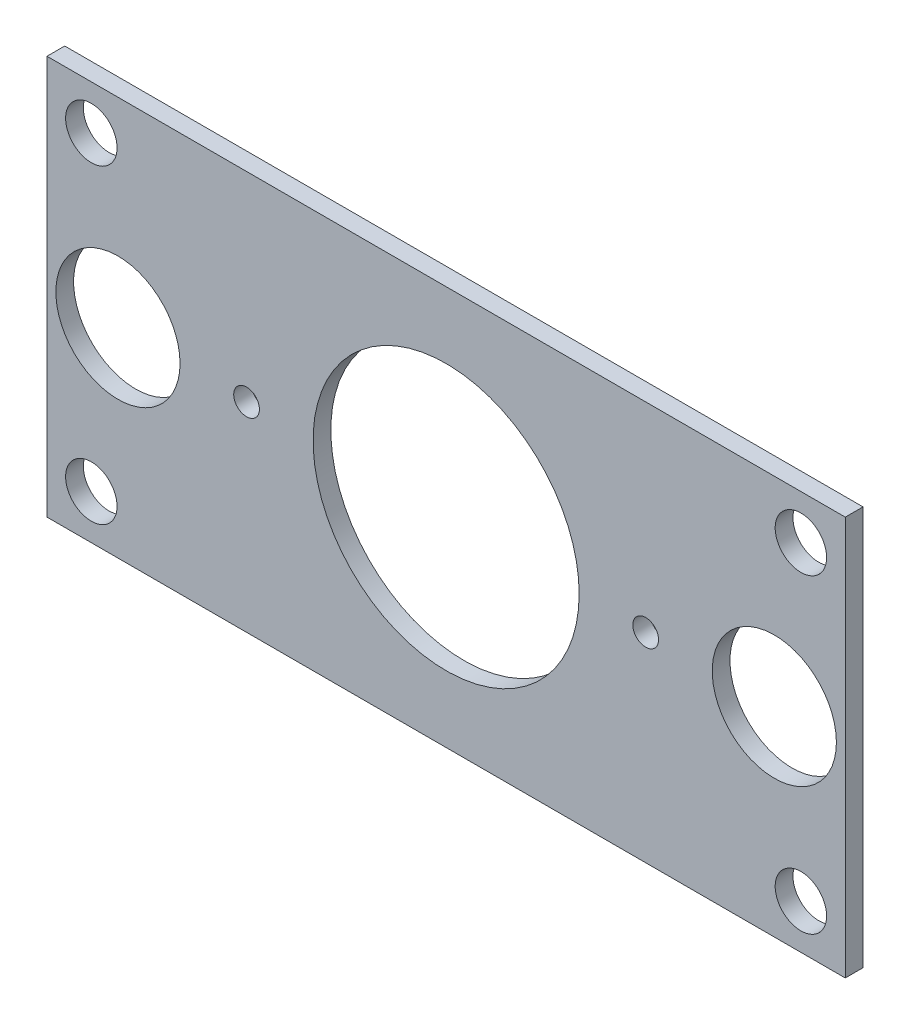
ISO-10303-21;
HEADER;
FILE_DESCRIPTION(('STEP AP214'),'2;1');
FILE_NAME('part.step','',(''),(''),'','','');
FILE_SCHEMA(('AUTOMOTIVE_DESIGN { 1 0 10303 214 1 1 1 1 }'));
ENDSEC;
DATA;
#1=APPLICATION_CONTEXT('core data for automotive mechanical design processes');
#2=APPLICATION_PROTOCOL_DEFINITION('international standard','automotive_design',2000,#1);
#3=PRODUCT_CONTEXT('',#1,'mechanical');
#4=PRODUCT('Part','Part','',(#3));
#5=PRODUCT_RELATED_PRODUCT_CATEGORY('part','',(#4));
#6=PRODUCT_DEFINITION_FORMATION('','',#4);
#7=PRODUCT_DEFINITION_CONTEXT('part definition',#1,'design');
#8=PRODUCT_DEFINITION('design','',#6,#7);
#9=PRODUCT_DEFINITION_SHAPE('','',#8);
#10=(LENGTH_UNIT() NAMED_UNIT(*) SI_UNIT(.MILLI.,.METRE.));
#11=(NAMED_UNIT(*) PLANE_ANGLE_UNIT() SI_UNIT($,.RADIAN.));
#12=(NAMED_UNIT(*) SI_UNIT($,.STERADIAN.) SOLID_ANGLE_UNIT());
#13=UNCERTAINTY_MEASURE_WITH_UNIT(LENGTH_MEASURE(1.E-05),#10,'distance_accuracy_value','');
#14=(GEOMETRIC_REPRESENTATION_CONTEXT(3) GLOBAL_UNCERTAINTY_ASSIGNED_CONTEXT((#13)) GLOBAL_UNIT_ASSIGNED_CONTEXT((#10,
#11,#12)) REPRESENTATION_CONTEXT('',''));
#15=CARTESIAN_POINT('',(0.,0.,0.));
#16=DIRECTION('',(0.,0.,1.));
#17=DIRECTION('',(1.,0.,0.));
#18=AXIS2_PLACEMENT_3D('',#15,#16,#17);
#19=CARTESIAN_POINT('',(45.,22.5,-2.));
#20=DIRECTION('',(1.,0.,0.));
#21=DIRECTION('',(0.,0.,-1.));
#22=AXIS2_PLACEMENT_3D('',#19,#20,#21);
#23=PLANE('',#22);
#24=DIRECTION('',(0.,1.,0.));
#25=VECTOR('',#24,1.);
#26=CARTESIAN_POINT('',(45.,22.5,0.));
#27=LINE('',#26,#25);
#28=CARTESIAN_POINT('',(45.,-22.5,0.));
#29=VERTEX_POINT('',#28);
#30=CARTESIAN_POINT('',(45.,22.5,0.));
#31=VERTEX_POINT('',#30);
#32=EDGE_CURVE('E99',#29,#31,#27,.T.);
#33=ORIENTED_EDGE('',*,*,#32,.F.);
#34=DIRECTION('',(0.,0.,1.));
#35=VECTOR('',#34,1.);
#36=CARTESIAN_POINT('',(45.,-22.5,-2.));
#37=LINE('',#36,#35);
#38=CARTESIAN_POINT('',(45.,-22.5,-2.));
#39=VERTEX_POINT('',#38);
#40=EDGE_CURVE('E11',#39,#29,#37,.T.);
#41=ORIENTED_EDGE('',*,*,#40,.F.);
#42=DIRECTION('',(0.,1.,0.));
#43=VECTOR('',#42,1.);
#44=CARTESIAN_POINT('',(45.,22.5,-2.));
#45=LINE('',#44,#43);
#46=CARTESIAN_POINT('',(45.,22.5,-2.));
#47=VERTEX_POINT('',#46);
#48=EDGE_CURVE('E92',#39,#47,#45,.T.);
#49=ORIENTED_EDGE('',*,*,#48,.T.);
#50=DIRECTION('',(0.,0.,1.));
#51=VECTOR('',#50,1.);
#52=CARTESIAN_POINT('',(45.,22.5,-2.));
#53=LINE('',#52,#51);
#54=EDGE_CURVE('E37',#47,#31,#53,.T.);
#55=ORIENTED_EDGE('',*,*,#54,.T.);
#56=EDGE_LOOP('',(#33,#41,#49,#55));
#57=FACE_BOUND('',#56,.T.);
#58=ADVANCED_FACE('F34',(#57),#23,.T.);
#59=CARTESIAN_POINT('',(-45.,-22.5,-2.));
#60=DIRECTION('',(0.,-1.,0.));
#61=DIRECTION('',(0.,0.,-1.));
#62=AXIS2_PLACEMENT_3D('',#59,#60,#61);
#63=PLANE('',#62);
#64=DIRECTION('',(1.,0.,0.));
#65=VECTOR('',#64,1.);
#66=CARTESIAN_POINT('',(-45.,-22.5,0.));
#67=LINE('',#66,#65);
#68=CARTESIAN_POINT('',(-45.,-22.5,0.));
#69=VERTEX_POINT('',#68);
#70=EDGE_CURVE('E94',#69,#29,#67,.T.);
#71=ORIENTED_EDGE('',*,*,#70,.F.);
#72=DIRECTION('',(0.,0.,1.));
#73=VECTOR('',#72,1.);
#74=CARTESIAN_POINT('',(-45.,-22.5,-2.));
#75=LINE('',#74,#73);
#76=CARTESIAN_POINT('',(-45.,-22.5,-2.));
#77=VERTEX_POINT('',#76);
#78=EDGE_CURVE('E43',#77,#69,#75,.T.);
#79=ORIENTED_EDGE('',*,*,#78,.F.);
#80=DIRECTION('',(1.,0.,0.));
#81=VECTOR('',#80,1.);
#82=CARTESIAN_POINT('',(-45.,-22.5,-2.));
#83=LINE('',#82,#81);
#84=EDGE_CURVE('E89',#77,#39,#83,.T.);
#85=ORIENTED_EDGE('',*,*,#84,.T.);
#86=ORIENTED_EDGE('',*,*,#40,.T.);
#87=EDGE_LOOP('',(#71,#79,#85,#86));
#88=FACE_BOUND('',#87,.T.);
#89=ADVANCED_FACE('F110',(#88),#63,.T.);
#90=CARTESIAN_POINT('',(-45.,22.5,-2.));
#91=DIRECTION('',(-1.,0.,0.));
#92=DIRECTION('',(0.,-1.,0.));
#93=AXIS2_PLACEMENT_3D('',#90,#91,#92);
#94=PLANE('',#93);
#95=DIRECTION('',(0.,-1.,0.));
#96=VECTOR('',#95,1.);
#97=CARTESIAN_POINT('',(-45.,22.5,0.));
#98=LINE('',#97,#96);
#99=CARTESIAN_POINT('',(-45.,22.5,0.));
#100=VERTEX_POINT('',#99);
#101=EDGE_CURVE('E84',#100,#69,#98,.T.);
#102=ORIENTED_EDGE('',*,*,#101,.F.);
#103=DIRECTION('',(0.,0.,1.));
#104=VECTOR('',#103,1.);
#105=CARTESIAN_POINT('',(-45.,22.5,-2.));
#106=LINE('',#105,#104);
#107=CARTESIAN_POINT('',(-45.,22.5,-2.));
#108=VERTEX_POINT('',#107);
#109=EDGE_CURVE('E79',#108,#100,#106,.T.);
#110=ORIENTED_EDGE('',*,*,#109,.F.);
#111=DIRECTION('',(0.,-1.,0.));
#112=VECTOR('',#111,1.);
#113=CARTESIAN_POINT('',(-45.,22.5,-2.));
#114=LINE('',#113,#112);
#115=EDGE_CURVE('E82',#108,#77,#114,.T.);
#116=ORIENTED_EDGE('',*,*,#115,.T.);
#117=ORIENTED_EDGE('',*,*,#78,.T.);
#118=EDGE_LOOP('',(#102,#110,#116,#117));
#119=FACE_BOUND('',#118,.T.);
#120=ADVANCED_FACE('F81',(#119),#94,.T.);
#121=CARTESIAN_POINT('',(-45.,22.5,-2.));
#122=DIRECTION('',(0.,1.,0.));
#123=DIRECTION('',(0.,0.,1.));
#124=AXIS2_PLACEMENT_3D('',#121,#122,#123);
#125=PLANE('',#124);
#126=DIRECTION('',(-1.,0.,0.));
#127=VECTOR('',#126,1.);
#128=CARTESIAN_POINT('',(-45.,22.5,0.));
#129=LINE('',#128,#127);
#130=EDGE_CURVE('E102',#31,#100,#129,.T.);
#131=ORIENTED_EDGE('',*,*,#130,.F.);
#132=ORIENTED_EDGE('',*,*,#54,.F.);
#133=DIRECTION('',(-1.,0.,0.));
#134=VECTOR('',#133,1.);
#135=CARTESIAN_POINT('',(-45.,22.5,-2.));
#136=LINE('',#135,#134);
#137=EDGE_CURVE('E88',#47,#108,#136,.T.);
#138=ORIENTED_EDGE('',*,*,#137,.T.);
#139=ORIENTED_EDGE('',*,*,#109,.T.);
#140=EDGE_LOOP('',(#131,#132,#138,#139));
#141=FACE_BOUND('',#140,.T.);
#142=ADVANCED_FACE('F91',(#141),#125,.T.);
#143=CARTESIAN_POINT('',(0.,0.,-2.));
#144=DIRECTION('',(0.,0.,1.));
#145=DIRECTION('',(1.,0.,0.));
#146=AXIS2_PLACEMENT_3D('',#143,#144,#145);
#147=PLANE('',#146);
#148=CARTESIAN_POINT('',(-22.5,0.,-2.));
#149=DIRECTION('',(0.,0.,1.));
#150=DIRECTION('',(1.,0.,0.));
#151=AXIS2_PLACEMENT_3D('',#148,#149,#150);
#152=CIRCLE('',#151,1.45);
#153=CARTESIAN_POINT('',(-21.05,0.,-2.));
#154=VERTEX_POINT('',#153);
#155=EDGE_CURVE('E171',#154,#154,#152,.T.);
#156=ORIENTED_EDGE('',*,*,#155,.T.);
#157=EDGE_LOOP('',(#156));
#158=FACE_BOUND('',#157,.T.);
#159=CARTESIAN_POINT('',(22.5,0.,-2.));
#160=DIRECTION('',(0.,0.,1.));
#161=DIRECTION('',(1.,0.,0.));
#162=AXIS2_PLACEMENT_3D('',#159,#160,#161);
#163=CIRCLE('',#162,1.45);
#164=CARTESIAN_POINT('',(23.95,0.,-2.));
#165=VERTEX_POINT('',#164);
#166=EDGE_CURVE('E179',#165,#165,#163,.T.);
#167=ORIENTED_EDGE('',*,*,#166,.T.);
#168=EDGE_LOOP('',(#167));
#169=FACE_BOUND('',#168,.T.);
#170=CARTESIAN_POINT('',(37.,0.,-2.));
#171=DIRECTION('',(0.,0.,1.));
#172=DIRECTION('',(1.,0.,0.));
#173=AXIS2_PLACEMENT_3D('',#170,#171,#172);
#174=CIRCLE('',#173,7.);
#175=CARTESIAN_POINT('',(44.,0.,-2.));
#176=VERTEX_POINT('',#175);
#177=EDGE_CURVE('E185',#176,#176,#174,.T.);
#178=ORIENTED_EDGE('',*,*,#177,.T.);
#179=EDGE_LOOP('',(#178));
#180=FACE_BOUND('',#179,.T.);
#181=CARTESIAN_POINT('',(-37.,0.,-2.));
#182=DIRECTION('',(0.,0.,1.));
#183=DIRECTION('',(1.,0.,0.));
#184=AXIS2_PLACEMENT_3D('',#181,#182,#183);
#185=CIRCLE('',#184,7.);
#186=CARTESIAN_POINT('',(-30.,0.,-2.));
#187=VERTEX_POINT('',#186);
#188=EDGE_CURVE('E191',#187,#187,#185,.T.);
#189=ORIENTED_EDGE('',*,*,#188,.T.);
#190=EDGE_LOOP('',(#189));
#191=FACE_BOUND('',#190,.T.);
#192=CARTESIAN_POINT('',(0.,0.,-2.));
#193=DIRECTION('',(0.,0.,1.));
#194=DIRECTION('',(1.,0.,0.));
#195=AXIS2_PLACEMENT_3D('',#192,#193,#194);
#196=CIRCLE('',#195,15.);
#197=CARTESIAN_POINT('',(15.,0.,-2.));
#198=VERTEX_POINT('',#197);
#199=EDGE_CURVE('E197',#198,#198,#196,.T.);
#200=ORIENTED_EDGE('',*,*,#199,.T.);
#201=EDGE_LOOP('',(#200));
#202=FACE_BOUND('',#201,.T.);
#203=CARTESIAN_POINT('',(40.0000000000001,-17.5000000000001,-2.));
#204=DIRECTION('',(0.,0.,1.));
#205=DIRECTION('',(1.,0.,0.));
#206=AXIS2_PLACEMENT_3D('',#203,#204,#205);
#207=CIRCLE('',#206,2.9);
#208=CARTESIAN_POINT('',(42.9000000000001,-17.5000000000001,-2.));
#209=VERTEX_POINT('',#208);
#210=EDGE_CURVE('E203',#209,#209,#207,.T.);
#211=ORIENTED_EDGE('',*,*,#210,.T.);
#212=EDGE_LOOP('',(#211));
#213=FACE_BOUND('',#212,.T.);
#214=CARTESIAN_POINT('',(40.0000000000001,17.5,-2.));
#215=DIRECTION('',(0.,0.,1.));
#216=DIRECTION('',(1.,0.,0.));
#217=AXIS2_PLACEMENT_3D('',#214,#215,#216);
#218=CIRCLE('',#217,2.9);
#219=CARTESIAN_POINT('',(42.9000000000001,17.5,-2.));
#220=VERTEX_POINT('',#219);
#221=EDGE_CURVE('E209',#220,#220,#218,.T.);
#222=ORIENTED_EDGE('',*,*,#221,.T.);
#223=EDGE_LOOP('',(#222));
#224=FACE_BOUND('',#223,.T.);
#225=CARTESIAN_POINT('',(-40.,-17.5000000000001,-2.));
#226=DIRECTION('',(0.,0.,1.));
#227=DIRECTION('',(1.,0.,0.));
#228=AXIS2_PLACEMENT_3D('',#225,#226,#227);
#229=CIRCLE('',#228,2.9);
#230=CARTESIAN_POINT('',(-37.1,-17.5000000000001,-2.));
#231=VERTEX_POINT('',#230);
#232=EDGE_CURVE('E215',#231,#231,#229,.T.);
#233=ORIENTED_EDGE('',*,*,#232,.T.);
#234=EDGE_LOOP('',(#233));
#235=FACE_BOUND('',#234,.T.);
#236=CARTESIAN_POINT('',(-40.,17.5,-2.));
#237=DIRECTION('',(0.,0.,1.));
#238=DIRECTION('',(1.,0.,0.));
#239=AXIS2_PLACEMENT_3D('',#236,#237,#238);
#240=CIRCLE('',#239,2.9);
#241=CARTESIAN_POINT('',(-37.1,17.5,-2.));
#242=VERTEX_POINT('',#241);
#243=EDGE_CURVE('E103',#242,#242,#240,.T.);
#244=ORIENTED_EDGE('',*,*,#243,.T.);
#245=EDGE_LOOP('',(#244));
#246=FACE_BOUND('',#245,.T.);
#247=ORIENTED_EDGE('',*,*,#48,.F.);
#248=ORIENTED_EDGE('',*,*,#84,.F.);
#249=ORIENTED_EDGE('',*,*,#115,.F.);
#250=ORIENTED_EDGE('',*,*,#137,.F.);
#251=EDGE_LOOP('',(#247,#248,#249,#250));
#252=FACE_BOUND('',#251,.T.);
#253=ADVANCED_FACE('F87',(#158,#169,#180,#191,#202,#213,#224,#235,#246,#252),#147,.F.);
#254=CARTESIAN_POINT('',(0.,0.,0.));
#255=DIRECTION('',(0.,0.,1.));
#256=DIRECTION('',(1.,0.,0.));
#257=AXIS2_PLACEMENT_3D('',#254,#255,#256);
#258=PLANE('',#257);
#259=CARTESIAN_POINT('',(-22.5,0.,0.));
#260=DIRECTION('',(0.,0.,1.));
#261=DIRECTION('',(1.,0.,0.));
#262=AXIS2_PLACEMENT_3D('',#259,#260,#261);
#263=CIRCLE('',#262,1.45);
#264=CARTESIAN_POINT('',(-21.05,0.,0.));
#265=VERTEX_POINT('',#264);
#266=EDGE_CURVE('E174',#265,#265,#263,.T.);
#267=ORIENTED_EDGE('',*,*,#266,.F.);
#268=EDGE_LOOP('',(#267));
#269=FACE_BOUND('',#268,.T.);
#270=CARTESIAN_POINT('',(22.5,0.,0.));
#271=DIRECTION('',(0.,0.,1.));
#272=DIRECTION('',(1.,0.,0.));
#273=AXIS2_PLACEMENT_3D('',#270,#271,#272);
#274=CIRCLE('',#273,1.45);
#275=CARTESIAN_POINT('',(23.95,0.,0.));
#276=VERTEX_POINT('',#275);
#277=EDGE_CURVE('E176',#276,#276,#274,.T.);
#278=ORIENTED_EDGE('',*,*,#277,.F.);
#279=EDGE_LOOP('',(#278));
#280=FACE_BOUND('',#279,.T.);
#281=CARTESIAN_POINT('',(37.,0.,0.));
#282=DIRECTION('',(0.,0.,1.));
#283=DIRECTION('',(1.,0.,0.));
#284=AXIS2_PLACEMENT_3D('',#281,#282,#283);
#285=CIRCLE('',#284,7.);
#286=CARTESIAN_POINT('',(44.,0.,0.));
#287=VERTEX_POINT('',#286);
#288=EDGE_CURVE('E182',#287,#287,#285,.T.);
#289=ORIENTED_EDGE('',*,*,#288,.F.);
#290=EDGE_LOOP('',(#289));
#291=FACE_BOUND('',#290,.T.);
#292=CARTESIAN_POINT('',(-37.,0.,0.));
#293=DIRECTION('',(0.,0.,1.));
#294=DIRECTION('',(1.,0.,0.));
#295=AXIS2_PLACEMENT_3D('',#292,#293,#294);
#296=CIRCLE('',#295,7.);
#297=CARTESIAN_POINT('',(-30.,0.,0.));
#298=VERTEX_POINT('',#297);
#299=EDGE_CURVE('E188',#298,#298,#296,.T.);
#300=ORIENTED_EDGE('',*,*,#299,.F.);
#301=EDGE_LOOP('',(#300));
#302=FACE_BOUND('',#301,.T.);
#303=CARTESIAN_POINT('',(0.,0.,0.));
#304=DIRECTION('',(0.,0.,1.));
#305=DIRECTION('',(1.,0.,0.));
#306=AXIS2_PLACEMENT_3D('',#303,#304,#305);
#307=CIRCLE('',#306,15.);
#308=CARTESIAN_POINT('',(15.,0.,0.));
#309=VERTEX_POINT('',#308);
#310=EDGE_CURVE('E194',#309,#309,#307,.T.);
#311=ORIENTED_EDGE('',*,*,#310,.F.);
#312=EDGE_LOOP('',(#311));
#313=FACE_BOUND('',#312,.T.);
#314=CARTESIAN_POINT('',(40.0000000000001,-17.5000000000001,0.));
#315=DIRECTION('',(0.,0.,1.));
#316=DIRECTION('',(1.,0.,0.));
#317=AXIS2_PLACEMENT_3D('',#314,#315,#316);
#318=CIRCLE('',#317,2.9);
#319=CARTESIAN_POINT('',(42.9000000000001,-17.5000000000001,0.));
#320=VERTEX_POINT('',#319);
#321=EDGE_CURVE('E200',#320,#320,#318,.T.);
#322=ORIENTED_EDGE('',*,*,#321,.F.);
#323=EDGE_LOOP('',(#322));
#324=FACE_BOUND('',#323,.T.);
#325=CARTESIAN_POINT('',(40.0000000000001,17.5,0.));
#326=DIRECTION('',(0.,0.,1.));
#327=DIRECTION('',(1.,0.,0.));
#328=AXIS2_PLACEMENT_3D('',#325,#326,#327);
#329=CIRCLE('',#328,2.9);
#330=CARTESIAN_POINT('',(42.9000000000001,17.5,0.));
#331=VERTEX_POINT('',#330);
#332=EDGE_CURVE('E206',#331,#331,#329,.T.);
#333=ORIENTED_EDGE('',*,*,#332,.F.);
#334=EDGE_LOOP('',(#333));
#335=FACE_BOUND('',#334,.T.);
#336=CARTESIAN_POINT('',(-40.,-17.5000000000001,0.));
#337=DIRECTION('',(0.,0.,1.));
#338=DIRECTION('',(1.,0.,0.));
#339=AXIS2_PLACEMENT_3D('',#336,#337,#338);
#340=CIRCLE('',#339,2.9);
#341=CARTESIAN_POINT('',(-37.1,-17.5000000000001,0.));
#342=VERTEX_POINT('',#341);
#343=EDGE_CURVE('E212',#342,#342,#340,.T.);
#344=ORIENTED_EDGE('',*,*,#343,.F.);
#345=EDGE_LOOP('',(#344));
#346=FACE_BOUND('',#345,.T.);
#347=CARTESIAN_POINT('',(-40.,17.5,0.));
#348=DIRECTION('',(0.,0.,1.));
#349=DIRECTION('',(1.,0.,0.));
#350=AXIS2_PLACEMENT_3D('',#347,#348,#349);
#351=CIRCLE('',#350,2.9);
#352=CARTESIAN_POINT('',(-37.1,17.5,0.));
#353=VERTEX_POINT('',#352);
#354=EDGE_CURVE('E218',#353,#353,#351,.T.);
#355=ORIENTED_EDGE('',*,*,#354,.F.);
#356=EDGE_LOOP('',(#355));
#357=FACE_BOUND('',#356,.T.);
#358=ORIENTED_EDGE('',*,*,#32,.T.);
#359=ORIENTED_EDGE('',*,*,#130,.T.);
#360=ORIENTED_EDGE('',*,*,#101,.T.);
#361=ORIENTED_EDGE('',*,*,#70,.T.);
#362=EDGE_LOOP('',(#358,#359,#360,#361));
#363=FACE_BOUND('',#362,.T.);
#364=ADVANCED_FACE('F109',(#269,#280,#291,#302,#313,#324,#335,#346,#357,#363),#258,.T.);
#365=CARTESIAN_POINT('',(-40.,17.5,-2.));
#366=DIRECTION('',(0.,0.,1.));
#367=DIRECTION('',(1.,0.,0.));
#368=AXIS2_PLACEMENT_3D('',#365,#366,#367);
#369=CYLINDRICAL_SURFACE('',#368,2.9);
#370=ORIENTED_EDGE('',*,*,#243,.F.);
#371=EDGE_LOOP('',(#370));
#372=FACE_BOUND('',#371,.T.);
#373=ORIENTED_EDGE('',*,*,#354,.T.);
#374=EDGE_LOOP('',(#373));
#375=FACE_BOUND('',#374,.T.);
#376=ADVANCED_FACE('F128',(#372,#375),#369,.F.);
#377=CARTESIAN_POINT('',(-40.,-17.5000000000001,-2.));
#378=DIRECTION('',(0.,0.,1.));
#379=DIRECTION('',(1.,0.,0.));
#380=AXIS2_PLACEMENT_3D('',#377,#378,#379);
#381=CYLINDRICAL_SURFACE('',#380,2.9);
#382=ORIENTED_EDGE('',*,*,#232,.F.);
#383=EDGE_LOOP('',(#382));
#384=FACE_BOUND('',#383,.T.);
#385=ORIENTED_EDGE('',*,*,#343,.T.);
#386=EDGE_LOOP('',(#385));
#387=FACE_BOUND('',#386,.T.);
#388=ADVANCED_FACE('F135',(#384,#387),#381,.F.);
#389=CARTESIAN_POINT('',(40.0000000000001,17.5,-2.));
#390=DIRECTION('',(0.,0.,1.));
#391=DIRECTION('',(1.,0.,0.));
#392=AXIS2_PLACEMENT_3D('',#389,#390,#391);
#393=CYLINDRICAL_SURFACE('',#392,2.9);
#394=ORIENTED_EDGE('',*,*,#221,.F.);
#395=EDGE_LOOP('',(#394));
#396=FACE_BOUND('',#395,.T.);
#397=ORIENTED_EDGE('',*,*,#332,.T.);
#398=EDGE_LOOP('',(#397));
#399=FACE_BOUND('',#398,.T.);
#400=ADVANCED_FACE('F139',(#396,#399),#393,.F.);
#401=CARTESIAN_POINT('',(40.0000000000001,-17.5000000000001,-2.));
#402=DIRECTION('',(0.,0.,1.));
#403=DIRECTION('',(1.,0.,0.));
#404=AXIS2_PLACEMENT_3D('',#401,#402,#403);
#405=CYLINDRICAL_SURFACE('',#404,2.9);
#406=ORIENTED_EDGE('',*,*,#210,.F.);
#407=EDGE_LOOP('',(#406));
#408=FACE_BOUND('',#407,.T.);
#409=ORIENTED_EDGE('',*,*,#321,.T.);
#410=EDGE_LOOP('',(#409));
#411=FACE_BOUND('',#410,.T.);
#412=ADVANCED_FACE('F143',(#408,#411),#405,.F.);
#413=CARTESIAN_POINT('',(0.,0.,-2.));
#414=DIRECTION('',(0.,0.,1.));
#415=DIRECTION('',(1.,0.,0.));
#416=AXIS2_PLACEMENT_3D('',#413,#414,#415);
#417=CYLINDRICAL_SURFACE('',#416,15.);
#418=ORIENTED_EDGE('',*,*,#199,.F.);
#419=EDGE_LOOP('',(#418));
#420=FACE_BOUND('',#419,.T.);
#421=ORIENTED_EDGE('',*,*,#310,.T.);
#422=EDGE_LOOP('',(#421));
#423=FACE_BOUND('',#422,.T.);
#424=ADVANCED_FACE('F147',(#420,#423),#417,.F.);
#425=CARTESIAN_POINT('',(-37.,0.,-2.));
#426=DIRECTION('',(0.,0.,1.));
#427=DIRECTION('',(1.,0.,0.));
#428=AXIS2_PLACEMENT_3D('',#425,#426,#427);
#429=CYLINDRICAL_SURFACE('',#428,7.);
#430=ORIENTED_EDGE('',*,*,#188,.F.);
#431=EDGE_LOOP('',(#430));
#432=FACE_BOUND('',#431,.T.);
#433=ORIENTED_EDGE('',*,*,#299,.T.);
#434=EDGE_LOOP('',(#433));
#435=FACE_BOUND('',#434,.T.);
#436=ADVANCED_FACE('F151',(#432,#435),#429,.F.);
#437=CARTESIAN_POINT('',(37.,0.,-2.));
#438=DIRECTION('',(0.,0.,1.));
#439=DIRECTION('',(1.,0.,0.));
#440=AXIS2_PLACEMENT_3D('',#437,#438,#439);
#441=CYLINDRICAL_SURFACE('',#440,7.);
#442=ORIENTED_EDGE('',*,*,#177,.F.);
#443=EDGE_LOOP('',(#442));
#444=FACE_BOUND('',#443,.T.);
#445=ORIENTED_EDGE('',*,*,#288,.T.);
#446=EDGE_LOOP('',(#445));
#447=FACE_BOUND('',#446,.T.);
#448=ADVANCED_FACE('F155',(#444,#447),#441,.F.);
#449=CARTESIAN_POINT('',(22.5,0.,-2.));
#450=DIRECTION('',(0.,0.,1.));
#451=DIRECTION('',(1.,0.,0.));
#452=AXIS2_PLACEMENT_3D('',#449,#450,#451);
#453=CYLINDRICAL_SURFACE('',#452,1.45);
#454=ORIENTED_EDGE('',*,*,#166,.F.);
#455=EDGE_LOOP('',(#454));
#456=FACE_BOUND('',#455,.T.);
#457=ORIENTED_EDGE('',*,*,#277,.T.);
#458=EDGE_LOOP('',(#457));
#459=FACE_BOUND('',#458,.T.);
#460=ADVANCED_FACE('F159',(#456,#459),#453,.F.);
#461=CARTESIAN_POINT('',(-22.5,0.,-2.));
#462=DIRECTION('',(0.,0.,1.));
#463=DIRECTION('',(1.,0.,0.));
#464=AXIS2_PLACEMENT_3D('',#461,#462,#463);
#465=CYLINDRICAL_SURFACE('',#464,1.45);
#466=ORIENTED_EDGE('',*,*,#155,.F.);
#467=EDGE_LOOP('',(#466));
#468=FACE_BOUND('',#467,.T.);
#469=ORIENTED_EDGE('',*,*,#266,.T.);
#470=EDGE_LOOP('',(#469));
#471=FACE_BOUND('',#470,.T.);
#472=ADVANCED_FACE('F163',(#468,#471),#465,.F.);
#473=CLOSED_SHELL('',(#58,#89,#120,#142,#253,#364,#376,#388,#400,#412,#424,#436,#448,#460,#472));
#474=MANIFOLD_SOLID_BREP('B2',#473);
#475=ADVANCED_BREP_SHAPE_REPRESENTATION('',(#18,#474),#14);
#476=SHAPE_DEFINITION_REPRESENTATION(#9,#475);
ENDSEC;
END-ISO-10303-21;
